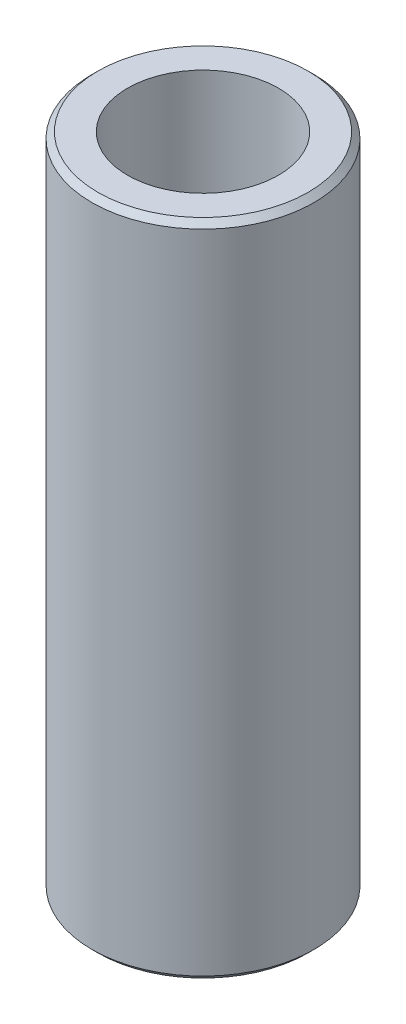
ISO-10303-21;
HEADER;
FILE_DESCRIPTION(('STEP AP214'),'2;1');
FILE_NAME('part.step','',(''),(''),'','','');
FILE_SCHEMA(('AUTOMOTIVE_DESIGN { 1 0 10303 214 1 1 1 1 }'));
ENDSEC;
DATA;
#1=APPLICATION_CONTEXT('core data for automotive mechanical design processes');
#2=APPLICATION_PROTOCOL_DEFINITION('international standard','automotive_design',2000,#1);
#3=PRODUCT_CONTEXT('',#1,'mechanical');
#4=PRODUCT('Part','Part','',(#3));
#5=PRODUCT_RELATED_PRODUCT_CATEGORY('part','',(#4));
#6=PRODUCT_DEFINITION_FORMATION('','',#4);
#7=PRODUCT_DEFINITION_CONTEXT('part definition',#1,'design');
#8=PRODUCT_DEFINITION('design','',#6,#7);
#9=PRODUCT_DEFINITION_SHAPE('','',#8);
#10=(LENGTH_UNIT() NAMED_UNIT(*) SI_UNIT(.MILLI.,.METRE.));
#11=(NAMED_UNIT(*) PLANE_ANGLE_UNIT() SI_UNIT($,.RADIAN.));
#12=(NAMED_UNIT(*) SI_UNIT($,.STERADIAN.) SOLID_ANGLE_UNIT());
#13=UNCERTAINTY_MEASURE_WITH_UNIT(LENGTH_MEASURE(1.E-05),#10,'distance_accuracy_value','');
#14=(GEOMETRIC_REPRESENTATION_CONTEXT(3) GLOBAL_UNCERTAINTY_ASSIGNED_CONTEXT((#13)) GLOBAL_UNIT_ASSIGNED_CONTEXT((#10,
#11,#12)) REPRESENTATION_CONTEXT('',''));
#15=CARTESIAN_POINT('',(0.,0.,0.));
#16=DIRECTION('',(0.,0.,1.));
#17=DIRECTION('',(1.,0.,0.));
#18=AXIS2_PLACEMENT_3D('',#15,#16,#17);
#19=CARTESIAN_POINT('',(0.,14.12875,0.));
#20=DIRECTION('',(0.,-1.,0.));
#21=DIRECTION('',(0.,0.,-1.));
#22=AXIS2_PLACEMENT_3D('',#19,#20,#21);
#23=CYLINDRICAL_SURFACE('',#22,4.7625);
#24=CARTESIAN_POINT('',(0.,13.87475,0.));
#25=DIRECTION('',(0.,1.,0.));
#26=DIRECTION('',(0.,0.,1.));
#27=AXIS2_PLACEMENT_3D('',#24,#25,#26);
#28=CIRCLE('',#27,4.7625);
#29=CARTESIAN_POINT('',(0.,13.87475,4.7625));
#30=VERTEX_POINT('',#29);
#31=EDGE_CURVE('E43',#30,#30,#28,.F.);
#32=ORIENTED_EDGE('',*,*,#31,.T.);
#33=EDGE_LOOP('',(#32));
#34=FACE_BOUND('',#33,.T.);
#35=CARTESIAN_POINT('',(0.,-13.87475,0.));
#36=DIRECTION('',(0.,1.,0.));
#37=DIRECTION('',(0.,0.,1.));
#38=AXIS2_PLACEMENT_3D('',#35,#36,#37);
#39=CIRCLE('',#38,4.7625);
#40=CARTESIAN_POINT('',(0.,-13.87475,4.7625));
#41=VERTEX_POINT('',#40);
#42=EDGE_CURVE('E47',#41,#41,#39,.T.);
#43=ORIENTED_EDGE('',*,*,#42,.T.);
#44=EDGE_LOOP('',(#43));
#45=FACE_BOUND('',#44,.T.);
#46=ADVANCED_FACE('F35',(#34,#45),#23,.T.);
#47=CARTESIAN_POINT('',(0.,14.12875,0.));
#48=DIRECTION('',(0.,1.,0.));
#49=DIRECTION('',(0.,0.,1.));
#50=AXIS2_PLACEMENT_3D('',#47,#48,#49);
#51=PLANE('',#50);
#52=CARTESIAN_POINT('',(0.,14.12875,0.));
#53=DIRECTION('',(0.,-1.,0.));
#54=DIRECTION('',(0.,0.,-1.));
#55=AXIS2_PLACEMENT_3D('',#52,#53,#54);
#56=CIRCLE('',#55,3.2385);
#57=CARTESIAN_POINT('',(0.,14.12875,-3.2385));
#58=VERTEX_POINT('',#57);
#59=EDGE_CURVE('E56',#58,#58,#56,.T.);
#60=ORIENTED_EDGE('',*,*,#59,.T.);
#61=EDGE_LOOP('',(#60));
#62=FACE_BOUND('',#61,.T.);
#63=CARTESIAN_POINT('',(0.,14.12875,0.));
#64=DIRECTION('',(0.,1.,0.));
#65=DIRECTION('',(0.,0.,1.));
#66=AXIS2_PLACEMENT_3D('',#63,#64,#65);
#67=CIRCLE('',#66,4.50850000000001);
#68=CARTESIAN_POINT('',(0.,14.12875,4.50850000000001));
#69=VERTEX_POINT('',#68);
#70=EDGE_CURVE('E51',#69,#69,#67,.T.);
#71=ORIENTED_EDGE('',*,*,#70,.T.);
#72=EDGE_LOOP('',(#71));
#73=FACE_BOUND('',#72,.T.);
#74=ADVANCED_FACE('F63',(#62,#73),#51,.T.);
#75=CARTESIAN_POINT('',(0.,-14.12875,0.));
#76=DIRECTION('',(0.,1.,0.));
#77=DIRECTION('',(0.,0.,1.));
#78=AXIS2_PLACEMENT_3D('',#75,#76,#77);
#79=PLANE('',#78);
#80=CARTESIAN_POINT('',(0.,-14.12875,0.));
#81=DIRECTION('',(0.,-1.,0.));
#82=DIRECTION('',(0.,0.,-1.));
#83=AXIS2_PLACEMENT_3D('',#80,#81,#82);
#84=CIRCLE('',#83,3.2385);
#85=CARTESIAN_POINT('',(0.,-14.12875,-3.2385));
#86=VERTEX_POINT('',#85);
#87=EDGE_CURVE('E57',#86,#86,#84,.T.);
#88=ORIENTED_EDGE('',*,*,#87,.F.);
#89=EDGE_LOOP('',(#88));
#90=FACE_BOUND('',#89,.T.);
#91=CARTESIAN_POINT('',(0.,-14.12875,0.));
#92=DIRECTION('',(0.,1.,0.));
#93=DIRECTION('',(0.,0.,1.));
#94=AXIS2_PLACEMENT_3D('',#91,#92,#93);
#95=CIRCLE('',#94,4.50849999999998);
#96=CARTESIAN_POINT('',(0.,-14.12875,4.50849999999998));
#97=VERTEX_POINT('',#96);
#98=EDGE_CURVE('E10',#97,#97,#95,.F.);
#99=ORIENTED_EDGE('',*,*,#98,.T.);
#100=EDGE_LOOP('',(#99));
#101=FACE_BOUND('',#100,.T.);
#102=ADVANCED_FACE('F72',(#90,#101),#79,.F.);
#103=CARTESIAN_POINT('',(0.,14.12875,0.));
#104=DIRECTION('',(0.,-1.,0.));
#105=DIRECTION('',(0.,0.,-1.));
#106=AXIS2_PLACEMENT_3D('',#103,#104,#105);
#107=CONICAL_SURFACE('',#106,4.50850000000001,0.785398163397445);
#108=ORIENTED_EDGE('',*,*,#31,.F.);
#109=EDGE_LOOP('',(#108));
#110=FACE_BOUND('',#109,.T.);
#111=ORIENTED_EDGE('',*,*,#70,.F.);
#112=EDGE_LOOP('',(#111));
#113=FACE_BOUND('',#112,.T.);
#114=ADVANCED_FACE('F74',(#110,#113),#107,.T.);
#115=CARTESIAN_POINT('',(0.,-13.87475,0.));
#116=DIRECTION('',(0.,1.,0.));
#117=DIRECTION('',(0.,0.,1.));
#118=AXIS2_PLACEMENT_3D('',#115,#116,#117);
#119=CONICAL_SURFACE('',#118,4.7625,0.785398163397459);
#120=ORIENTED_EDGE('',*,*,#98,.F.);
#121=EDGE_LOOP('',(#120));
#122=FACE_BOUND('',#121,.T.);
#123=ORIENTED_EDGE('',*,*,#42,.F.);
#124=EDGE_LOOP('',(#123));
#125=FACE_BOUND('',#124,.T.);
#126=ADVANCED_FACE('F38',(#122,#125),#119,.T.);
#127=CARTESIAN_POINT('',(0.,14.12875,0.));
#128=DIRECTION('',(0.,-1.,0.));
#129=DIRECTION('',(0.,0.,-1.));
#130=AXIS2_PLACEMENT_3D('',#127,#128,#129);
#131=CYLINDRICAL_SURFACE('',#130,3.2385);
#132=ORIENTED_EDGE('',*,*,#59,.F.);
#133=EDGE_LOOP('',(#132));
#134=FACE_BOUND('',#133,.T.);
#135=ORIENTED_EDGE('',*,*,#87,.T.);
#136=EDGE_LOOP('',(#135));
#137=FACE_BOUND('',#136,.T.);
#138=ADVANCED_FACE('F66',(#134,#137),#131,.F.);
#139=CLOSED_SHELL('',(#46,#74,#102,#114,#126,#138));
#140=MANIFOLD_SOLID_BREP('B2',#139);
#141=ADVANCED_BREP_SHAPE_REPRESENTATION('',(#18,#140),#14);
#142=SHAPE_DEFINITION_REPRESENTATION(#9,#141);
ENDSEC;
END-ISO-10303-21;
